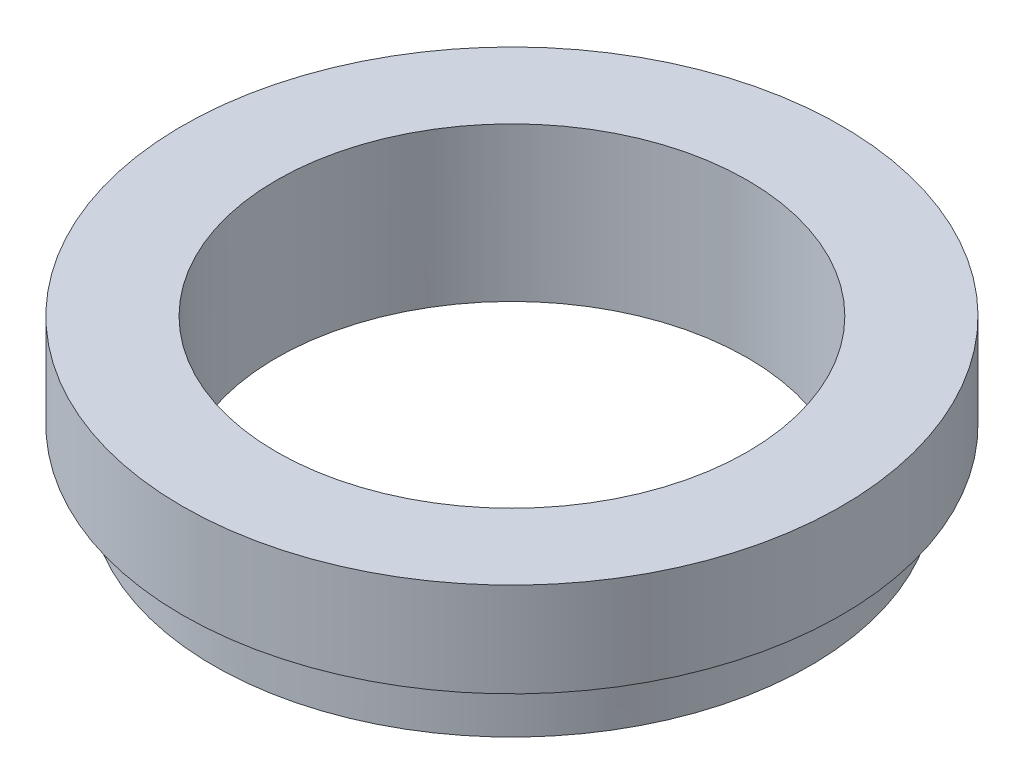
ISO-10303-21;
HEADER;
FILE_DESCRIPTION(('STEP AP214'),'2;1');
FILE_NAME('part.step','',(''),(''),'','','');
FILE_SCHEMA(('AUTOMOTIVE_DESIGN { 1 0 10303 214 1 1 1 1 }'));
ENDSEC;
DATA;
#1=APPLICATION_CONTEXT('core data for automotive mechanical design processes');
#2=APPLICATION_PROTOCOL_DEFINITION('international standard','automotive_design',2000,#1);
#3=PRODUCT_CONTEXT('',#1,'mechanical');
#4=PRODUCT('Part','Part','',(#3));
#5=PRODUCT_RELATED_PRODUCT_CATEGORY('part','',(#4));
#6=PRODUCT_DEFINITION_FORMATION('','',#4);
#7=PRODUCT_DEFINITION_CONTEXT('part definition',#1,'design');
#8=PRODUCT_DEFINITION('design','',#6,#7);
#9=PRODUCT_DEFINITION_SHAPE('','',#8);
#10=(LENGTH_UNIT() NAMED_UNIT(*) SI_UNIT(.MILLI.,.METRE.));
#11=(NAMED_UNIT(*) PLANE_ANGLE_UNIT() SI_UNIT($,.RADIAN.));
#12=(NAMED_UNIT(*) SI_UNIT($,.STERADIAN.) SOLID_ANGLE_UNIT());
#13=UNCERTAINTY_MEASURE_WITH_UNIT(LENGTH_MEASURE(1.E-05),#10,'distance_accuracy_value','');
#14=(GEOMETRIC_REPRESENTATION_CONTEXT(3) GLOBAL_UNCERTAINTY_ASSIGNED_CONTEXT((#13)) GLOBAL_UNIT_ASSIGNED_CONTEXT((#10,
#11,#12)) REPRESENTATION_CONTEXT('',''));
#15=CARTESIAN_POINT('',(0.,0.,0.));
#16=DIRECTION('',(0.,0.,1.));
#17=DIRECTION('',(1.,0.,0.));
#18=AXIS2_PLACEMENT_3D('',#15,#16,#17);
#19=CARTESIAN_POINT('',(0.,5.,0.));
#20=DIRECTION('',(0.,-1.,0.));
#21=DIRECTION('',(0.,0.,-1.));
#22=AXIS2_PLACEMENT_3D('',#19,#20,#21);
#23=CYLINDRICAL_SURFACE('',#22,9.5);
#24=CARTESIAN_POINT('',(0.,2.,0.));
#25=DIRECTION('',(0.,1.,0.));
#26=DIRECTION('',(0.,0.,1.));
#27=AXIS2_PLACEMENT_3D('',#24,#25,#26);
#28=CIRCLE('',#27,9.5);
#29=CARTESIAN_POINT('',(0.,2.,9.5));
#30=VERTEX_POINT('',#29);
#31=EDGE_CURVE('E10',#30,#30,#28,.T.);
#32=ORIENTED_EDGE('',*,*,#31,.F.);
#33=EDGE_LOOP('',(#32));
#34=FACE_BOUND('',#33,.T.);
#35=CARTESIAN_POINT('',(0.,0.1,0.));
#36=DIRECTION('',(0.,-1.,0.));
#37=DIRECTION('',(0.,0.,-1.));
#38=AXIS2_PLACEMENT_3D('',#35,#36,#37);
#39=CIRCLE('',#38,9.5);
#40=CARTESIAN_POINT('',(0.,0.1,-9.5));
#41=VERTEX_POINT('',#40);
#42=EDGE_CURVE('E54',#41,#41,#39,.T.);
#43=ORIENTED_EDGE('',*,*,#42,.F.);
#44=EDGE_LOOP('',(#43));
#45=FACE_BOUND('',#44,.T.);
#46=ADVANCED_FACE('F35',(#34,#45),#23,.T.);
#47=CARTESIAN_POINT('',(0.,5.,0.));
#48=DIRECTION('',(0.,-1.,0.));
#49=DIRECTION('',(0.,0.,-1.));
#50=AXIS2_PLACEMENT_3D('',#47,#48,#49);
#51=CYLINDRICAL_SURFACE('',#50,7.5);
#52=CARTESIAN_POINT('',(0.,5.,0.));
#53=DIRECTION('',(0.,1.,0.));
#54=DIRECTION('',(0.,0.,1.));
#55=AXIS2_PLACEMENT_3D('',#52,#53,#54);
#56=CIRCLE('',#55,7.5);
#57=CARTESIAN_POINT('',(0.,5.,7.5));
#58=VERTEX_POINT('',#57);
#59=EDGE_CURVE('E42',#58,#58,#56,.T.);
#60=ORIENTED_EDGE('',*,*,#59,.T.);
#61=EDGE_LOOP('',(#60));
#62=FACE_BOUND('',#61,.T.);
#63=CARTESIAN_POINT('',(0.,0.1,0.));
#64=DIRECTION('',(0.,-1.,0.));
#65=DIRECTION('',(0.,0.,-1.));
#66=AXIS2_PLACEMENT_3D('',#63,#64,#65);
#67=CIRCLE('',#66,7.5);
#68=CARTESIAN_POINT('',(0.,0.1,-7.5));
#69=VERTEX_POINT('',#68);
#70=EDGE_CURVE('E38',#69,#69,#67,.T.);
#71=ORIENTED_EDGE('',*,*,#70,.T.);
#72=EDGE_LOOP('',(#71));
#73=FACE_BOUND('',#72,.T.);
#74=ADVANCED_FACE('F61',(#62,#73),#51,.F.);
#75=CARTESIAN_POINT('',(0.,5.,0.));
#76=DIRECTION('',(0.,1.,0.));
#77=DIRECTION('',(0.,0.,1.));
#78=AXIS2_PLACEMENT_3D('',#75,#76,#77);
#79=PLANE('',#78);
#80=ORIENTED_EDGE('',*,*,#59,.F.);
#81=EDGE_LOOP('',(#80));
#82=FACE_BOUND('',#81,.T.);
#83=CARTESIAN_POINT('',(0.,5.,0.));
#84=DIRECTION('',(0.,1.,0.));
#85=DIRECTION('',(0.,0.,1.));
#86=AXIS2_PLACEMENT_3D('',#83,#84,#85);
#87=CIRCLE('',#86,10.5);
#88=CARTESIAN_POINT('',(0.,5.,10.5));
#89=VERTEX_POINT('',#88);
#90=EDGE_CURVE('E49',#89,#89,#87,.T.);
#91=ORIENTED_EDGE('',*,*,#90,.T.);
#92=EDGE_LOOP('',(#91));
#93=FACE_BOUND('',#92,.T.);
#94=ADVANCED_FACE('F78',(#82,#93),#79,.T.);
#95=CARTESIAN_POINT('',(0.,2.,0.));
#96=DIRECTION('',(0.,1.,0.));
#97=DIRECTION('',(0.,0.,1.));
#98=AXIS2_PLACEMENT_3D('',#95,#96,#97);
#99=CYLINDRICAL_SURFACE('',#98,10.5);
#100=CARTESIAN_POINT('',(0.,2.,0.));
#101=DIRECTION('',(0.,1.,0.));
#102=DIRECTION('',(0.,0.,1.));
#103=AXIS2_PLACEMENT_3D('',#100,#101,#102);
#104=CIRCLE('',#103,10.5);
#105=CARTESIAN_POINT('',(0.,2.,10.5));
#106=VERTEX_POINT('',#105);
#107=EDGE_CURVE('E46',#106,#106,#104,.T.);
#108=ORIENTED_EDGE('',*,*,#107,.T.);
#109=EDGE_LOOP('',(#108));
#110=FACE_BOUND('',#109,.T.);
#111=ORIENTED_EDGE('',*,*,#90,.F.);
#112=EDGE_LOOP('',(#111));
#113=FACE_BOUND('',#112,.T.);
#114=ADVANCED_FACE('F71',(#110,#113),#99,.T.);
#115=CARTESIAN_POINT('',(0.,2.,0.));
#116=DIRECTION('',(0.,1.,0.));
#117=DIRECTION('',(0.,0.,1.));
#118=AXIS2_PLACEMENT_3D('',#115,#116,#117);
#119=PLANE('',#118);
#120=ORIENTED_EDGE('',*,*,#31,.T.);
#121=EDGE_LOOP('',(#120));
#122=FACE_BOUND('',#121,.T.);
#123=ORIENTED_EDGE('',*,*,#107,.F.);
#124=EDGE_LOOP('',(#123));
#125=FACE_BOUND('',#124,.T.);
#126=ADVANCED_FACE('F65',(#122,#125),#119,.F.);
#127=CARTESIAN_POINT('',(0.,0.1,0.));
#128=DIRECTION('',(0.,-1.,0.));
#129=DIRECTION('',(0.,0.,-1.));
#130=AXIS2_PLACEMENT_3D('',#127,#128,#129);
#131=PLANE('',#130);
#132=ORIENTED_EDGE('',*,*,#70,.F.);
#133=EDGE_LOOP('',(#132));
#134=FACE_BOUND('',#133,.T.);
#135=ORIENTED_EDGE('',*,*,#42,.T.);
#136=EDGE_LOOP('',(#135));
#137=FACE_BOUND('',#136,.T.);
#138=ADVANCED_FACE('F63',(#134,#137),#131,.T.);
#139=CLOSED_SHELL('',(#46,#74,#94,#114,#126,#138));
#140=MANIFOLD_SOLID_BREP('B2',#139);
#141=ADVANCED_BREP_SHAPE_REPRESENTATION('',(#18,#140),#14);
#142=SHAPE_DEFINITION_REPRESENTATION(#9,#141);
ENDSEC;
END-ISO-10303-21;
